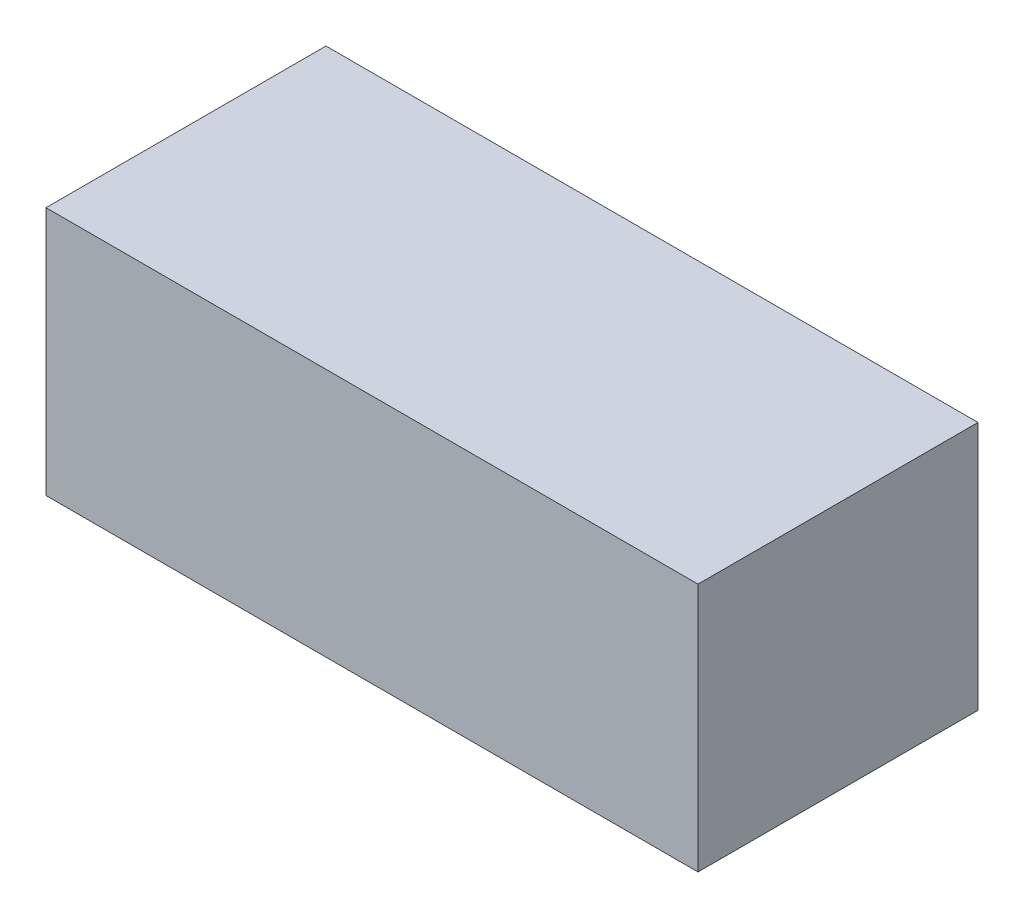
ISO-10303-21;
HEADER;
FILE_DESCRIPTION(('STEP AP214'),'2;1');
FILE_NAME('part.step','',(''),(''),'','','');
FILE_SCHEMA(('AUTOMOTIVE_DESIGN { 1 0 10303 214 1 1 1 1 }'));
ENDSEC;
DATA;
#1=APPLICATION_CONTEXT('core data for automotive mechanical design processes');
#2=APPLICATION_PROTOCOL_DEFINITION('international standard','automotive_design',2000,#1);
#3=PRODUCT_CONTEXT('',#1,'mechanical');
#4=PRODUCT('Part','Part','',(#3));
#5=PRODUCT_RELATED_PRODUCT_CATEGORY('part','',(#4));
#6=PRODUCT_DEFINITION_FORMATION('','',#4);
#7=PRODUCT_DEFINITION_CONTEXT('part definition',#1,'design');
#8=PRODUCT_DEFINITION('design','',#6,#7);
#9=PRODUCT_DEFINITION_SHAPE('','',#8);
#10=(LENGTH_UNIT() NAMED_UNIT(*) SI_UNIT(.MILLI.,.METRE.));
#11=(NAMED_UNIT(*) PLANE_ANGLE_UNIT() SI_UNIT($,.RADIAN.));
#12=(NAMED_UNIT(*) SI_UNIT($,.STERADIAN.) SOLID_ANGLE_UNIT());
#13=UNCERTAINTY_MEASURE_WITH_UNIT(LENGTH_MEASURE(1.E-05),#10,'distance_accuracy_value','');
#14=(GEOMETRIC_REPRESENTATION_CONTEXT(3) GLOBAL_UNCERTAINTY_ASSIGNED_CONTEXT((#13)) GLOBAL_UNIT_ASSIGNED_CONTEXT((#10,
#11,#12)) REPRESENTATION_CONTEXT('',''));
#15=CARTESIAN_POINT('',(0.,0.,0.));
#16=DIRECTION('',(0.,0.,1.));
#17=DIRECTION('',(1.,0.,0.));
#18=AXIS2_PLACEMENT_3D('',#15,#16,#17);
#19=CARTESIAN_POINT('',(21.59,16.51,9.271));
#20=DIRECTION('',(-1.,0.,0.));
#21=DIRECTION('',(0.,0.,1.));
#22=AXIS2_PLACEMENT_3D('',#19,#20,#21);
#23=PLANE('',#22);
#24=DIRECTION('',(0.,0.,-1.));
#25=VECTOR('',#24,1.);
#26=CARTESIAN_POINT('',(21.59,0.,9.271));
#27=LINE('',#26,#25);
#28=CARTESIAN_POINT('',(21.59,0.,9.271));
#29=VERTEX_POINT('',#28);
#30=CARTESIAN_POINT('',(21.59,0.,-9.271));
#31=VERTEX_POINT('',#30);
#32=EDGE_CURVE('E96',#29,#31,#27,.T.);
#33=ORIENTED_EDGE('',*,*,#32,.T.);
#34=DIRECTION('',(0.,-1.,0.));
#35=VECTOR('',#34,1.);
#36=CARTESIAN_POINT('',(21.59,16.51,-9.271));
#37=LINE('',#36,#35);
#38=CARTESIAN_POINT('',(21.59,16.51,-9.271));
#39=VERTEX_POINT('',#38);
#40=EDGE_CURVE('E11',#39,#31,#37,.T.);
#41=ORIENTED_EDGE('',*,*,#40,.F.);
#42=DIRECTION('',(0.,0.,-1.));
#43=VECTOR('',#42,1.);
#44=CARTESIAN_POINT('',(21.59,16.51,9.271));
#45=LINE('',#44,#43);
#46=CARTESIAN_POINT('',(21.59,16.51,9.271));
#47=VERTEX_POINT('',#46);
#48=EDGE_CURVE('E84',#47,#39,#45,.T.);
#49=ORIENTED_EDGE('',*,*,#48,.F.);
#50=DIRECTION('',(0.,-1.,0.));
#51=VECTOR('',#50,1.);
#52=CARTESIAN_POINT('',(21.59,16.51,9.271));
#53=LINE('',#52,#51);
#54=EDGE_CURVE('E92',#47,#29,#53,.T.);
#55=ORIENTED_EDGE('',*,*,#54,.T.);
#56=EDGE_LOOP('',(#33,#41,#49,#55));
#57=FACE_BOUND('',#56,.T.);
#58=ADVANCED_FACE('F33',(#57),#23,.F.);
#59=CARTESIAN_POINT('',(-21.59,16.51,-9.271));
#60=DIRECTION('',(0.,0.,1.));
#61=DIRECTION('',(1.,0.,0.));
#62=AXIS2_PLACEMENT_3D('',#59,#60,#61);
#63=PLANE('',#62);
#64=DIRECTION('',(-1.,0.,0.));
#65=VECTOR('',#64,1.);
#66=CARTESIAN_POINT('',(-21.59,0.,-9.271));
#67=LINE('',#66,#65);
#68=CARTESIAN_POINT('',(-21.59,0.,-9.271));
#69=VERTEX_POINT('',#68);
#70=EDGE_CURVE('E88',#31,#69,#67,.T.);
#71=ORIENTED_EDGE('',*,*,#70,.T.);
#72=DIRECTION('',(0.,-1.,0.));
#73=VECTOR('',#72,1.);
#74=CARTESIAN_POINT('',(-21.59,16.51,-9.271));
#75=LINE('',#74,#73);
#76=CARTESIAN_POINT('',(-21.59,16.51,-9.271));
#77=VERTEX_POINT('',#76);
#78=EDGE_CURVE('E41',#77,#69,#75,.T.);
#79=ORIENTED_EDGE('',*,*,#78,.F.);
#80=DIRECTION('',(-1.,0.,0.));
#81=VECTOR('',#80,1.);
#82=CARTESIAN_POINT('',(-21.59,16.51,-9.271));
#83=LINE('',#82,#81);
#84=EDGE_CURVE('E79',#39,#77,#83,.T.);
#85=ORIENTED_EDGE('',*,*,#84,.F.);
#86=ORIENTED_EDGE('',*,*,#40,.T.);
#87=EDGE_LOOP('',(#71,#79,#85,#86));
#88=FACE_BOUND('',#87,.T.);
#89=ADVANCED_FACE('F87',(#88),#63,.F.);
#90=CARTESIAN_POINT('',(-21.59,16.51,9.271));
#91=DIRECTION('',(1.,0.,0.));
#92=DIRECTION('',(0.,0.,-1.));
#93=AXIS2_PLACEMENT_3D('',#90,#91,#92);
#94=PLANE('',#93);
#95=DIRECTION('',(0.,0.,1.));
#96=VECTOR('',#95,1.);
#97=CARTESIAN_POINT('',(-21.59,0.,9.271));
#98=LINE('',#97,#96);
#99=CARTESIAN_POINT('',(-21.59,0.,9.271));
#100=VERTEX_POINT('',#99);
#101=EDGE_CURVE('E66',#69,#100,#98,.T.);
#102=ORIENTED_EDGE('',*,*,#101,.T.);
#103=DIRECTION('',(0.,-1.,0.));
#104=VECTOR('',#103,1.);
#105=CARTESIAN_POINT('',(-21.59,16.51,9.271));
#106=LINE('',#105,#104);
#107=CARTESIAN_POINT('',(-21.59,16.51,9.271));
#108=VERTEX_POINT('',#107);
#109=EDGE_CURVE('E89',#108,#100,#106,.T.);
#110=ORIENTED_EDGE('',*,*,#109,.F.);
#111=DIRECTION('',(0.,0.,1.));
#112=VECTOR('',#111,1.);
#113=CARTESIAN_POINT('',(-21.59,16.51,9.271));
#114=LINE('',#113,#112);
#115=EDGE_CURVE('E82',#77,#108,#114,.T.);
#116=ORIENTED_EDGE('',*,*,#115,.F.);
#117=ORIENTED_EDGE('',*,*,#78,.T.);
#118=EDGE_LOOP('',(#102,#110,#116,#117));
#119=FACE_BOUND('',#118,.T.);
#120=ADVANCED_FACE('F90',(#119),#94,.F.);
#121=CARTESIAN_POINT('',(-21.59,16.51,9.271));
#122=DIRECTION('',(0.,0.,-1.));
#123=DIRECTION('',(-1.,0.,0.));
#124=AXIS2_PLACEMENT_3D('',#121,#122,#123);
#125=PLANE('',#124);
#126=DIRECTION('',(1.,0.,0.));
#127=VECTOR('',#126,1.);
#128=CARTESIAN_POINT('',(-21.59,0.,9.271));
#129=LINE('',#128,#127);
#130=EDGE_CURVE('E72',#100,#29,#129,.T.);
#131=ORIENTED_EDGE('',*,*,#130,.T.);
#132=ORIENTED_EDGE('',*,*,#54,.F.);
#133=DIRECTION('',(1.,0.,0.));
#134=VECTOR('',#133,1.);
#135=CARTESIAN_POINT('',(-21.59,16.51,9.271));
#136=LINE('',#135,#134);
#137=EDGE_CURVE('E49',#108,#47,#136,.T.);
#138=ORIENTED_EDGE('',*,*,#137,.F.);
#139=ORIENTED_EDGE('',*,*,#109,.T.);
#140=EDGE_LOOP('',(#131,#132,#138,#139));
#141=FACE_BOUND('',#140,.T.);
#142=ADVANCED_FACE('F103',(#141),#125,.F.);
#143=CARTESIAN_POINT('',(0.,16.51,0.));
#144=DIRECTION('',(0.,-1.,0.));
#145=DIRECTION('',(0.,0.,-1.));
#146=AXIS2_PLACEMENT_3D('',#143,#144,#145);
#147=PLANE('',#146);
#148=ORIENTED_EDGE('',*,*,#48,.T.);
#149=ORIENTED_EDGE('',*,*,#84,.T.);
#150=ORIENTED_EDGE('',*,*,#115,.T.);
#151=ORIENTED_EDGE('',*,*,#137,.T.);
#152=EDGE_LOOP('',(#148,#149,#150,#151));
#153=FACE_BOUND('',#152,.T.);
#154=ADVANCED_FACE('F80',(#153),#147,.F.);
#155=CARTESIAN_POINT('',(0.,0.,0.));
#156=DIRECTION('',(0.,-1.,0.));
#157=DIRECTION('',(0.,0.,-1.));
#158=AXIS2_PLACEMENT_3D('',#155,#156,#157);
#159=PLANE('',#158);
#160=ORIENTED_EDGE('',*,*,#32,.F.);
#161=ORIENTED_EDGE('',*,*,#130,.F.);
#162=ORIENTED_EDGE('',*,*,#101,.F.);
#163=ORIENTED_EDGE('',*,*,#70,.F.);
#164=EDGE_LOOP('',(#160,#161,#162,#163));
#165=FACE_BOUND('',#164,.T.);
#166=ADVANCED_FACE('F106',(#165),#159,.T.);
#167=CLOSED_SHELL('',(#58,#89,#120,#142,#154,#166));
#168=MANIFOLD_SOLID_BREP('B2',#167);
#169=ADVANCED_BREP_SHAPE_REPRESENTATION('',(#18,#168),#14);
#170=SHAPE_DEFINITION_REPRESENTATION(#9,#169);
ENDSEC;
END-ISO-10303-21;
